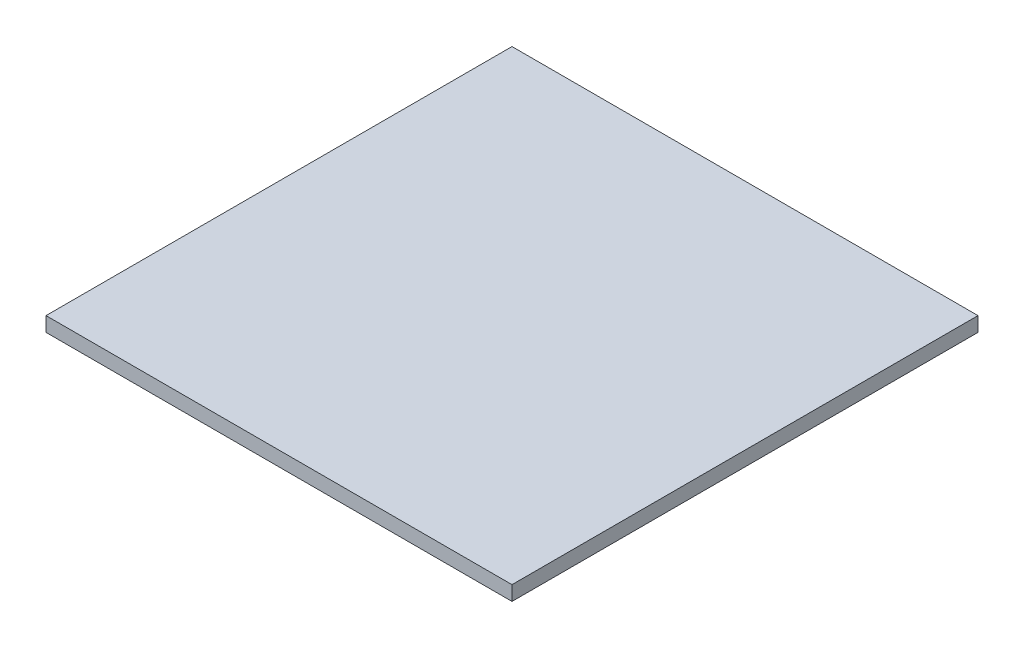
ISO-10303-21;
HEADER;
FILE_DESCRIPTION(('STEP AP214'),'2;1');
FILE_NAME('part.step','',(''),(''),'','','');
FILE_SCHEMA(('AUTOMOTIVE_DESIGN { 1 0 10303 214 1 1 1 1 }'));
ENDSEC;
DATA;
#1=APPLICATION_CONTEXT('core data for automotive mechanical design processes');
#2=APPLICATION_PROTOCOL_DEFINITION('international standard','automotive_design',2000,#1);
#3=PRODUCT_CONTEXT('',#1,'mechanical');
#4=PRODUCT('Part','Part','',(#3));
#5=PRODUCT_RELATED_PRODUCT_CATEGORY('part','',(#4));
#6=PRODUCT_DEFINITION_FORMATION('','',#4);
#7=PRODUCT_DEFINITION_CONTEXT('part definition',#1,'design');
#8=PRODUCT_DEFINITION('design','',#6,#7);
#9=PRODUCT_DEFINITION_SHAPE('','',#8);
#10=(LENGTH_UNIT() NAMED_UNIT(*) SI_UNIT(.MILLI.,.METRE.));
#11=(NAMED_UNIT(*) PLANE_ANGLE_UNIT() SI_UNIT($,.RADIAN.));
#12=(NAMED_UNIT(*) SI_UNIT($,.STERADIAN.) SOLID_ANGLE_UNIT());
#13=UNCERTAINTY_MEASURE_WITH_UNIT(LENGTH_MEASURE(1.E-05),#10,'distance_accuracy_value','');
#14=(GEOMETRIC_REPRESENTATION_CONTEXT(3) GLOBAL_UNCERTAINTY_ASSIGNED_CONTEXT((#13)) GLOBAL_UNIT_ASSIGNED_CONTEXT((#10,
#11,#12)) REPRESENTATION_CONTEXT('',''));
#15=CARTESIAN_POINT('',(0.,0.,0.));
#16=DIRECTION('',(0.,0.,1.));
#17=DIRECTION('',(1.,0.,0.));
#18=AXIS2_PLACEMENT_3D('',#15,#16,#17);
#19=CARTESIAN_POINT('',(0.,6.35,0.));
#20=DIRECTION('',(1.,0.,0.));
#21=DIRECTION('',(0.,0.,-1.));
#22=AXIS2_PLACEMENT_3D('',#19,#20,#21);
#23=PLANE('',#22);
#24=DIRECTION('',(0.,0.,1.));
#25=VECTOR('',#24,1.);
#26=CARTESIAN_POINT('',(0.,0.,0.));
#27=LINE('',#26,#25);
#28=CARTESIAN_POINT('',(0.,0.,-203.2));
#29=VERTEX_POINT('',#28);
#30=CARTESIAN_POINT('',(0.,0.,0.));
#31=VERTEX_POINT('',#30);
#32=EDGE_CURVE('E80',#29,#31,#27,.T.);
#33=ORIENTED_EDGE('',*,*,#32,.T.);
#34=DIRECTION('',(0.,-1.,0.));
#35=VECTOR('',#34,1.);
#36=CARTESIAN_POINT('',(0.,6.35,0.));
#37=LINE('',#36,#35);
#38=CARTESIAN_POINT('',(0.,6.35,0.));
#39=VERTEX_POINT('',#38);
#40=EDGE_CURVE('E11',#39,#31,#37,.T.);
#41=ORIENTED_EDGE('',*,*,#40,.F.);
#42=DIRECTION('',(0.,0.,1.));
#43=VECTOR('',#42,1.);
#44=CARTESIAN_POINT('',(0.,6.35,0.));
#45=LINE('',#44,#43);
#46=CARTESIAN_POINT('',(0.,6.35,-203.2));
#47=VERTEX_POINT('',#46);
#48=EDGE_CURVE('E68',#47,#39,#45,.T.);
#49=ORIENTED_EDGE('',*,*,#48,.F.);
#50=DIRECTION('',(0.,-1.,0.));
#51=VECTOR('',#50,1.);
#52=CARTESIAN_POINT('',(0.,6.35,-203.2));
#53=LINE('',#52,#51);
#54=EDGE_CURVE('E76',#47,#29,#53,.T.);
#55=ORIENTED_EDGE('',*,*,#54,.T.);
#56=EDGE_LOOP('',(#33,#41,#49,#55));
#57=FACE_BOUND('',#56,.T.);
#58=ADVANCED_FACE('F17',(#57),#23,.F.);
#59=CARTESIAN_POINT('',(0.,6.35,0.));
#60=DIRECTION('',(0.,0.,-1.));
#61=DIRECTION('',(-1.,0.,0.));
#62=AXIS2_PLACEMENT_3D('',#59,#60,#61);
#63=PLANE('',#62);
#64=DIRECTION('',(1.,0.,0.));
#65=VECTOR('',#64,1.);
#66=CARTESIAN_POINT('',(0.,0.,0.));
#67=LINE('',#66,#65);
#68=CARTESIAN_POINT('',(203.2,0.,0.));
#69=VERTEX_POINT('',#68);
#70=EDGE_CURVE('E72',#31,#69,#67,.T.);
#71=ORIENTED_EDGE('',*,*,#70,.T.);
#72=DIRECTION('',(0.,-1.,0.));
#73=VECTOR('',#72,1.);
#74=CARTESIAN_POINT('',(203.2,6.35,0.));
#75=LINE('',#74,#73);
#76=CARTESIAN_POINT('',(203.2,6.35,0.));
#77=VERTEX_POINT('',#76);
#78=EDGE_CURVE('E25',#77,#69,#75,.T.);
#79=ORIENTED_EDGE('',*,*,#78,.F.);
#80=DIRECTION('',(1.,0.,0.));
#81=VECTOR('',#80,1.);
#82=CARTESIAN_POINT('',(0.,6.35,0.));
#83=LINE('',#82,#81);
#84=EDGE_CURVE('E63',#39,#77,#83,.T.);
#85=ORIENTED_EDGE('',*,*,#84,.F.);
#86=ORIENTED_EDGE('',*,*,#40,.T.);
#87=EDGE_LOOP('',(#71,#79,#85,#86));
#88=FACE_BOUND('',#87,.T.);
#89=ADVANCED_FACE('F71',(#88),#63,.F.);
#90=CARTESIAN_POINT('',(203.2,6.35,0.));
#91=DIRECTION('',(-1.,0.,0.));
#92=DIRECTION('',(0.,0.,1.));
#93=AXIS2_PLACEMENT_3D('',#90,#91,#92);
#94=PLANE('',#93);
#95=DIRECTION('',(0.,0.,-1.));
#96=VECTOR('',#95,1.);
#97=CARTESIAN_POINT('',(203.2,0.,0.));
#98=LINE('',#97,#96);
#99=CARTESIAN_POINT('',(203.2,0.,-203.2));
#100=VERTEX_POINT('',#99);
#101=EDGE_CURVE('E50',#69,#100,#98,.T.);
#102=ORIENTED_EDGE('',*,*,#101,.T.);
#103=DIRECTION('',(0.,-1.,0.));
#104=VECTOR('',#103,1.);
#105=CARTESIAN_POINT('',(203.2,6.35,-203.2));
#106=LINE('',#105,#104);
#107=CARTESIAN_POINT('',(203.2,6.35,-203.2));
#108=VERTEX_POINT('',#107);
#109=EDGE_CURVE('E73',#108,#100,#106,.T.);
#110=ORIENTED_EDGE('',*,*,#109,.F.);
#111=DIRECTION('',(0.,0.,-1.));
#112=VECTOR('',#111,1.);
#113=CARTESIAN_POINT('',(203.2,6.35,0.));
#114=LINE('',#113,#112);
#115=EDGE_CURVE('E66',#77,#108,#114,.T.);
#116=ORIENTED_EDGE('',*,*,#115,.F.);
#117=ORIENTED_EDGE('',*,*,#78,.T.);
#118=EDGE_LOOP('',(#102,#110,#116,#117));
#119=FACE_BOUND('',#118,.T.);
#120=ADVANCED_FACE('F74',(#119),#94,.F.);
#121=CARTESIAN_POINT('',(0.,6.35,-203.2));
#122=DIRECTION('',(0.,0.,1.));
#123=DIRECTION('',(1.,0.,0.));
#124=AXIS2_PLACEMENT_3D('',#121,#122,#123);
#125=PLANE('',#124);
#126=DIRECTION('',(-1.,0.,0.));
#127=VECTOR('',#126,1.);
#128=CARTESIAN_POINT('',(0.,0.,-203.2));
#129=LINE('',#128,#127);
#130=EDGE_CURVE('E56',#100,#29,#129,.T.);
#131=ORIENTED_EDGE('',*,*,#130,.T.);
#132=ORIENTED_EDGE('',*,*,#54,.F.);
#133=DIRECTION('',(-1.,0.,0.));
#134=VECTOR('',#133,1.);
#135=CARTESIAN_POINT('',(0.,6.35,-203.2));
#136=LINE('',#135,#134);
#137=EDGE_CURVE('E33',#108,#47,#136,.T.);
#138=ORIENTED_EDGE('',*,*,#137,.F.);
#139=ORIENTED_EDGE('',*,*,#109,.T.);
#140=EDGE_LOOP('',(#131,#132,#138,#139));
#141=FACE_BOUND('',#140,.T.);
#142=ADVANCED_FACE('F87',(#141),#125,.F.);
#143=CARTESIAN_POINT('',(0.,6.35,-203.2));
#144=DIRECTION('',(0.,-1.,0.));
#145=DIRECTION('',(0.,0.,-1.));
#146=AXIS2_PLACEMENT_3D('',#143,#144,#145);
#147=PLANE('',#146);
#148=ORIENTED_EDGE('',*,*,#48,.T.);
#149=ORIENTED_EDGE('',*,*,#84,.T.);
#150=ORIENTED_EDGE('',*,*,#115,.T.);
#151=ORIENTED_EDGE('',*,*,#137,.T.);
#152=EDGE_LOOP('',(#148,#149,#150,#151));
#153=FACE_BOUND('',#152,.T.);
#154=ADVANCED_FACE('F64',(#153),#147,.F.);
#155=CARTESIAN_POINT('',(0.,0.,-203.2));
#156=DIRECTION('',(0.,-1.,0.));
#157=DIRECTION('',(0.,0.,-1.));
#158=AXIS2_PLACEMENT_3D('',#155,#156,#157);
#159=PLANE('',#158);
#160=ORIENTED_EDGE('',*,*,#32,.F.);
#161=ORIENTED_EDGE('',*,*,#130,.F.);
#162=ORIENTED_EDGE('',*,*,#101,.F.);
#163=ORIENTED_EDGE('',*,*,#70,.F.);
#164=EDGE_LOOP('',(#160,#161,#162,#163));
#165=FACE_BOUND('',#164,.T.);
#166=ADVANCED_FACE('F90',(#165),#159,.T.);
#167=CLOSED_SHELL('',(#58,#89,#120,#142,#154,#166));
#168=MANIFOLD_SOLID_BREP('B1',#167);
#169=ADVANCED_BREP_SHAPE_REPRESENTATION('',(#18,#168),#14);
#170=SHAPE_DEFINITION_REPRESENTATION(#9,#169);
ENDSEC;
END-ISO-10303-21;
